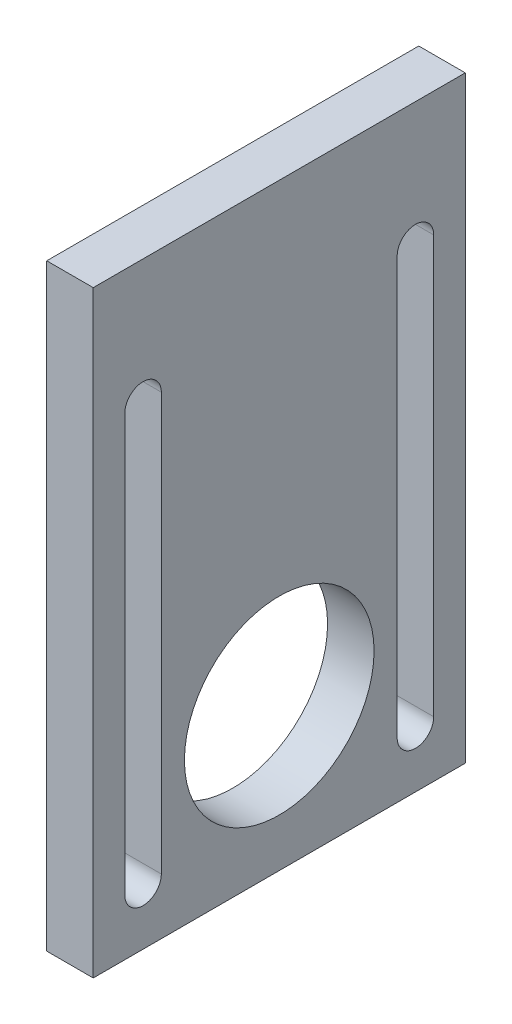
ISO-10303-21;
HEADER;
FILE_DESCRIPTION(('STEP AP214'),'2;1');
FILE_NAME('part.step','',(''),(''),'','','');
FILE_SCHEMA(('AUTOMOTIVE_DESIGN { 1 0 10303 214 1 1 1 1 }'));
ENDSEC;
DATA;
#1=APPLICATION_CONTEXT('core data for automotive mechanical design processes');
#2=APPLICATION_PROTOCOL_DEFINITION('international standard','automotive_design',2000,#1);
#3=PRODUCT_CONTEXT('',#1,'mechanical');
#4=PRODUCT('Part','Part','',(#3));
#5=PRODUCT_RELATED_PRODUCT_CATEGORY('part','',(#4));
#6=PRODUCT_DEFINITION_FORMATION('','',#4);
#7=PRODUCT_DEFINITION_CONTEXT('part definition',#1,'design');
#8=PRODUCT_DEFINITION('design','',#6,#7);
#9=PRODUCT_DEFINITION_SHAPE('','',#8);
#10=(LENGTH_UNIT() NAMED_UNIT(*) SI_UNIT(.MILLI.,.METRE.));
#11=(NAMED_UNIT(*) PLANE_ANGLE_UNIT() SI_UNIT($,.RADIAN.));
#12=(NAMED_UNIT(*) SI_UNIT($,.STERADIAN.) SOLID_ANGLE_UNIT());
#13=UNCERTAINTY_MEASURE_WITH_UNIT(LENGTH_MEASURE(1.E-05),#10,'distance_accuracy_value','');
#14=(GEOMETRIC_REPRESENTATION_CONTEXT(3) GLOBAL_UNCERTAINTY_ASSIGNED_CONTEXT((#13)) GLOBAL_UNIT_ASSIGNED_CONTEXT((#10,
#11,#12)) REPRESENTATION_CONTEXT('',''));
#15=CARTESIAN_POINT('',(0.,0.,0.));
#16=DIRECTION('',(0.,0.,1.));
#17=DIRECTION('',(1.,0.,0.));
#18=AXIS2_PLACEMENT_3D('',#15,#16,#17);
#19=CARTESIAN_POINT('',(7.,0.,0.));
#20=DIRECTION('',(0.,0.,-1.));
#21=DIRECTION('',(-1.,0.,0.));
#22=AXIS2_PLACEMENT_3D('',#19,#20,#21);
#23=PLANE('',#22);
#24=DIRECTION('',(0.,-1.,0.));
#25=VECTOR('',#24,1.);
#26=CARTESIAN_POINT('',(0.,0.,0.));
#27=LINE('',#26,#25);
#28=CARTESIAN_POINT('',(0.,90.,0.));
#29=VERTEX_POINT('',#28);
#30=CARTESIAN_POINT('',(0.,0.,0.));
#31=VERTEX_POINT('',#30);
#32=EDGE_CURVE('E199',#29,#31,#27,.T.);
#33=ORIENTED_EDGE('',*,*,#32,.T.);
#34=DIRECTION('',(-1.,0.,0.));
#35=VECTOR('',#34,1.);
#36=CARTESIAN_POINT('',(7.,0.,0.));
#37=LINE('',#36,#35);
#38=CARTESIAN_POINT('',(7.,0.,0.));
#39=VERTEX_POINT('',#38);
#40=EDGE_CURVE('E11',#39,#31,#37,.T.);
#41=ORIENTED_EDGE('',*,*,#40,.F.);
#42=DIRECTION('',(0.,-1.,0.));
#43=VECTOR('',#42,1.);
#44=CARTESIAN_POINT('',(7.,0.,0.));
#45=LINE('',#44,#43);
#46=CARTESIAN_POINT('',(7.,90.,0.));
#47=VERTEX_POINT('',#46);
#48=EDGE_CURVE('E201',#47,#39,#45,.T.);
#49=ORIENTED_EDGE('',*,*,#48,.F.);
#50=DIRECTION('',(-1.,0.,0.));
#51=VECTOR('',#50,1.);
#52=CARTESIAN_POINT('',(7.,90.,0.));
#53=LINE('',#52,#51);
#54=EDGE_CURVE('E213',#47,#29,#53,.T.);
#55=ORIENTED_EDGE('',*,*,#54,.T.);
#56=EDGE_LOOP('',(#33,#41,#49,#55));
#57=FACE_BOUND('',#56,.T.);
#58=ADVANCED_FACE('F39',(#57),#23,.F.);
#59=CARTESIAN_POINT('',(7.,0.,0.));
#60=DIRECTION('',(0.,1.,0.));
#61=DIRECTION('',(0.,0.,1.));
#62=AXIS2_PLACEMENT_3D('',#59,#60,#61);
#63=PLANE('',#62);
#64=DIRECTION('',(0.,0.,-1.));
#65=VECTOR('',#64,1.);
#66=CARTESIAN_POINT('',(0.,0.,0.));
#67=LINE('',#66,#65);
#68=CARTESIAN_POINT('',(0.,0.,-56.));
#69=VERTEX_POINT('',#68);
#70=EDGE_CURVE('E216',#31,#69,#67,.T.);
#71=ORIENTED_EDGE('',*,*,#70,.T.);
#72=DIRECTION('',(-1.,0.,0.));
#73=VECTOR('',#72,1.);
#74=CARTESIAN_POINT('',(7.,0.,-56.));
#75=LINE('',#74,#73);
#76=CARTESIAN_POINT('',(7.,0.,-56.));
#77=VERTEX_POINT('',#76);
#78=EDGE_CURVE('E46',#77,#69,#75,.T.);
#79=ORIENTED_EDGE('',*,*,#78,.F.);
#80=DIRECTION('',(0.,0.,-1.));
#81=VECTOR('',#80,1.);
#82=CARTESIAN_POINT('',(7.,0.,0.));
#83=LINE('',#82,#81);
#84=EDGE_CURVE('E206',#39,#77,#83,.T.);
#85=ORIENTED_EDGE('',*,*,#84,.F.);
#86=ORIENTED_EDGE('',*,*,#40,.T.);
#87=EDGE_LOOP('',(#71,#79,#85,#86));
#88=FACE_BOUND('',#87,.T.);
#89=ADVANCED_FACE('F243',(#88),#63,.F.);
#90=CARTESIAN_POINT('',(7.,0.,-56.));
#91=DIRECTION('',(0.,0.,1.));
#92=DIRECTION('',(1.,0.,0.));
#93=AXIS2_PLACEMENT_3D('',#90,#91,#92);
#94=PLANE('',#93);
#95=DIRECTION('',(0.,1.,0.));
#96=VECTOR('',#95,1.);
#97=CARTESIAN_POINT('',(0.,0.,-56.));
#98=LINE('',#97,#96);
#99=CARTESIAN_POINT('',(0.,90.,-56.));
#100=VERTEX_POINT('',#99);
#101=EDGE_CURVE('E217',#69,#100,#98,.T.);
#102=ORIENTED_EDGE('',*,*,#101,.T.);
#103=DIRECTION('',(-1.,0.,0.));
#104=VECTOR('',#103,1.);
#105=CARTESIAN_POINT('',(7.,90.,-56.));
#106=LINE('',#105,#104);
#107=CARTESIAN_POINT('',(7.,90.,-56.));
#108=VERTEX_POINT('',#107);
#109=EDGE_CURVE('E224',#108,#100,#106,.T.);
#110=ORIENTED_EDGE('',*,*,#109,.F.);
#111=DIRECTION('',(0.,1.,0.));
#112=VECTOR('',#111,1.);
#113=CARTESIAN_POINT('',(7.,0.,-56.));
#114=LINE('',#113,#112);
#115=EDGE_CURVE('E207',#77,#108,#114,.T.);
#116=ORIENTED_EDGE('',*,*,#115,.F.);
#117=ORIENTED_EDGE('',*,*,#78,.T.);
#118=EDGE_LOOP('',(#102,#110,#116,#117));
#119=FACE_BOUND('',#118,.T.);
#120=ADVANCED_FACE('F228',(#119),#94,.F.);
#121=CARTESIAN_POINT('',(7.,90.,0.));
#122=DIRECTION('',(0.,-1.,0.));
#123=DIRECTION('',(0.,0.,-1.));
#124=AXIS2_PLACEMENT_3D('',#121,#122,#123);
#125=PLANE('',#124);
#126=DIRECTION('',(0.,0.,1.));
#127=VECTOR('',#126,1.);
#128=CARTESIAN_POINT('',(0.,90.,0.));
#129=LINE('',#128,#127);
#130=EDGE_CURVE('E210',#100,#29,#129,.T.);
#131=ORIENTED_EDGE('',*,*,#130,.T.);
#132=ORIENTED_EDGE('',*,*,#54,.F.);
#133=DIRECTION('',(0.,0.,1.));
#134=VECTOR('',#133,1.);
#135=CARTESIAN_POINT('',(7.,90.,0.));
#136=LINE('',#135,#134);
#137=EDGE_CURVE('E211',#108,#47,#136,.T.);
#138=ORIENTED_EDGE('',*,*,#137,.F.);
#139=ORIENTED_EDGE('',*,*,#109,.T.);
#140=EDGE_LOOP('',(#131,#132,#138,#139));
#141=FACE_BOUND('',#140,.T.);
#142=ADVANCED_FACE('F236',(#141),#125,.F.);
#143=CARTESIAN_POINT('',(7.,0.,0.));
#144=DIRECTION('',(-1.,0.,0.));
#145=DIRECTION('',(0.,0.,1.));
#146=AXIS2_PLACEMENT_3D('',#143,#144,#145);
#147=PLANE('',#146);
#148=DIRECTION('',(0.,-1.,0.));
#149=VECTOR('',#148,1.);
#150=CARTESIAN_POINT('',(7.,71.2448174184033,-4.75));
#151=LINE('',#150,#149);
#152=CARTESIAN_POINT('',(7.,71.2448174184033,-4.75));
#153=VERTEX_POINT('',#152);
#154=CARTESIAN_POINT('',(7.,8.43498525922826,-4.75000000000001));
#155=VERTEX_POINT('',#154);
#156=EDGE_CURVE('E160',#153,#155,#151,.T.);
#157=ORIENTED_EDGE('',*,*,#156,.F.);
#158=CARTESIAN_POINT('',(7.,71.2448174184033,-7.5));
#159=DIRECTION('',(1.,0.,0.));
#160=DIRECTION('',(0.,0.,-1.));
#161=AXIS2_PLACEMENT_3D('',#158,#159,#160);
#162=CIRCLE('',#161,2.75);
#163=CARTESIAN_POINT('',(7.,71.2448174184033,-10.25));
#164=VERTEX_POINT('',#163);
#165=EDGE_CURVE('E52',#164,#153,#162,.T.);
#166=ORIENTED_EDGE('',*,*,#165,.F.);
#167=DIRECTION('',(0.,1.,0.));
#168=VECTOR('',#167,1.);
#169=CARTESIAN_POINT('',(7.,71.2448174184033,-10.25));
#170=LINE('',#169,#168);
#171=CARTESIAN_POINT('',(7.,8.43498525922826,-10.25));
#172=VERTEX_POINT('',#171);
#173=EDGE_CURVE('E146',#172,#164,#170,.T.);
#174=ORIENTED_EDGE('',*,*,#173,.F.);
#175=CARTESIAN_POINT('',(7.,8.43498525922826,-7.50000000000001));
#176=DIRECTION('',(1.,0.,0.));
#177=DIRECTION('',(0.,0.,-1.));
#178=AXIS2_PLACEMENT_3D('',#175,#176,#177);
#179=CIRCLE('',#178,2.75);
#180=EDGE_CURVE('E151',#155,#172,#179,.T.);
#181=ORIENTED_EDGE('',*,*,#180,.F.);
#182=EDGE_LOOP('',(#157,#166,#174,#181));
#183=FACE_BOUND('',#182,.T.);
#184=DIRECTION('',(0.,1.,0.));
#185=VECTOR('',#184,1.);
#186=CARTESIAN_POINT('',(7.,8.43498525922826,-51.25));
#187=LINE('',#186,#185);
#188=CARTESIAN_POINT('',(7.,8.43498525922826,-51.25));
#189=VERTEX_POINT('',#188);
#190=CARTESIAN_POINT('',(7.,71.2448174184033,-51.25));
#191=VERTEX_POINT('',#190);
#192=EDGE_CURVE('E181',#189,#191,#187,.T.);
#193=ORIENTED_EDGE('',*,*,#192,.F.);
#194=CARTESIAN_POINT('',(7.,8.43498525922826,-48.5));
#195=DIRECTION('',(1.,0.,0.));
#196=DIRECTION('',(0.,0.,-1.));
#197=AXIS2_PLACEMENT_3D('',#194,#195,#196);
#198=CIRCLE('',#197,2.75);
#199=CARTESIAN_POINT('',(7.,8.43498525922826,-45.75));
#200=VERTEX_POINT('',#199);
#201=EDGE_CURVE('E62',#200,#189,#198,.T.);
#202=ORIENTED_EDGE('',*,*,#201,.F.);
#203=DIRECTION('',(0.,-1.,0.));
#204=VECTOR('',#203,1.);
#205=CARTESIAN_POINT('',(7.,8.43498525922826,-45.75));
#206=LINE('',#205,#204);
#207=CARTESIAN_POINT('',(7.,71.2448174184033,-45.75));
#208=VERTEX_POINT('',#207);
#209=EDGE_CURVE('E177',#208,#200,#206,.T.);
#210=ORIENTED_EDGE('',*,*,#209,.F.);
#211=CARTESIAN_POINT('',(7.,71.2448174184033,-48.5));
#212=DIRECTION('',(1.,0.,0.));
#213=DIRECTION('',(0.,0.,-1.));
#214=AXIS2_PLACEMENT_3D('',#211,#212,#213);
#215=CIRCLE('',#214,2.75);
#216=EDGE_CURVE('E176',#191,#208,#215,.T.);
#217=ORIENTED_EDGE('',*,*,#216,.F.);
#218=EDGE_LOOP('',(#193,#202,#210,#217));
#219=FACE_BOUND('',#218,.T.);
#220=CARTESIAN_POINT('',(7.,21.5162892782246,-28.));
#221=DIRECTION('',(1.,0.,0.));
#222=DIRECTION('',(0.,0.,-1.));
#223=AXIS2_PLACEMENT_3D('',#220,#221,#222);
#224=CIRCLE('',#223,14.275);
#225=CARTESIAN_POINT('',(7.,21.5162892782246,-42.275));
#226=VERTEX_POINT('',#225);
#227=EDGE_CURVE('E162',#226,#226,#224,.T.);
#228=ORIENTED_EDGE('',*,*,#227,.F.);
#229=EDGE_LOOP('',(#228));
#230=FACE_BOUND('',#229,.T.);
#231=ORIENTED_EDGE('',*,*,#48,.T.);
#232=ORIENTED_EDGE('',*,*,#84,.T.);
#233=ORIENTED_EDGE('',*,*,#115,.T.);
#234=ORIENTED_EDGE('',*,*,#137,.T.);
#235=EDGE_LOOP('',(#231,#232,#233,#234));
#236=FACE_BOUND('',#235,.T.);
#237=ADVANCED_FACE('F241',(#183,#219,#230,#236),#147,.F.);
#238=CARTESIAN_POINT('',(0.,0.,0.));
#239=DIRECTION('',(-1.,0.,0.));
#240=DIRECTION('',(0.,0.,1.));
#241=AXIS2_PLACEMENT_3D('',#238,#239,#240);
#242=PLANE('',#241);
#243=CARTESIAN_POINT('',(0.,71.2448174184033,-7.5));
#244=DIRECTION('',(1.,0.,0.));
#245=DIRECTION('',(0.,0.,-1.));
#246=AXIS2_PLACEMENT_3D('',#243,#244,#245);
#247=CIRCLE('',#246,2.75);
#248=CARTESIAN_POINT('',(0.,71.2448174184033,-10.25));
#249=VERTEX_POINT('',#248);
#250=CARTESIAN_POINT('',(0.,71.2448174184033,-4.75));
#251=VERTEX_POINT('',#250);
#252=EDGE_CURVE('E129',#249,#251,#247,.T.);
#253=ORIENTED_EDGE('',*,*,#252,.T.);
#254=DIRECTION('',(0.,-1.,0.));
#255=VECTOR('',#254,1.);
#256=CARTESIAN_POINT('',(0.,71.2448174184033,-4.75));
#257=LINE('',#256,#255);
#258=CARTESIAN_POINT('',(0.,8.43498525922826,-4.75000000000001));
#259=VERTEX_POINT('',#258);
#260=EDGE_CURVE('E136',#251,#259,#257,.T.);
#261=ORIENTED_EDGE('',*,*,#260,.T.);
#262=CARTESIAN_POINT('',(0.,8.43498525922826,-7.50000000000001));
#263=DIRECTION('',(1.,0.,0.));
#264=DIRECTION('',(0.,0.,-1.));
#265=AXIS2_PLACEMENT_3D('',#262,#263,#264);
#266=CIRCLE('',#265,2.75);
#267=CARTESIAN_POINT('',(0.,8.43498525922826,-10.25));
#268=VERTEX_POINT('',#267);
#269=EDGE_CURVE('E141',#259,#268,#266,.T.);
#270=ORIENTED_EDGE('',*,*,#269,.T.);
#271=DIRECTION('',(0.,1.,0.));
#272=VECTOR('',#271,1.);
#273=CARTESIAN_POINT('',(0.,71.2448174184033,-10.25));
#274=LINE('',#273,#272);
#275=EDGE_CURVE('E133',#268,#249,#274,.T.);
#276=ORIENTED_EDGE('',*,*,#275,.T.);
#277=EDGE_LOOP('',(#253,#261,#270,#276));
#278=FACE_BOUND('',#277,.T.);
#279=CARTESIAN_POINT('',(0.,8.43498525922826,-48.5));
#280=DIRECTION('',(1.,0.,0.));
#281=DIRECTION('',(0.,0.,-1.));
#282=AXIS2_PLACEMENT_3D('',#279,#280,#281);
#283=CIRCLE('',#282,2.75);
#284=CARTESIAN_POINT('',(0.,8.43498525922826,-45.75));
#285=VERTEX_POINT('',#284);
#286=CARTESIAN_POINT('',(0.,8.43498525922826,-51.25));
#287=VERTEX_POINT('',#286);
#288=EDGE_CURVE('E178',#285,#287,#283,.T.);
#289=ORIENTED_EDGE('',*,*,#288,.T.);
#290=DIRECTION('',(0.,1.,0.));
#291=VECTOR('',#290,1.);
#292=CARTESIAN_POINT('',(0.,8.43498525922826,-51.25));
#293=LINE('',#292,#291);
#294=CARTESIAN_POINT('',(0.,71.2448174184033,-51.25));
#295=VERTEX_POINT('',#294);
#296=EDGE_CURVE('E194',#287,#295,#293,.T.);
#297=ORIENTED_EDGE('',*,*,#296,.T.);
#298=CARTESIAN_POINT('',(0.,71.2448174184033,-48.5));
#299=DIRECTION('',(1.,0.,0.));
#300=DIRECTION('',(0.,0.,-1.));
#301=AXIS2_PLACEMENT_3D('',#298,#299,#300);
#302=CIRCLE('',#301,2.75);
#303=CARTESIAN_POINT('',(0.,71.2448174184033,-45.75));
#304=VERTEX_POINT('',#303);
#305=EDGE_CURVE('E186',#295,#304,#302,.T.);
#306=ORIENTED_EDGE('',*,*,#305,.T.);
#307=DIRECTION('',(0.,-1.,0.));
#308=VECTOR('',#307,1.);
#309=CARTESIAN_POINT('',(0.,8.43498525922826,-45.75));
#310=LINE('',#309,#308);
#311=EDGE_CURVE('E166',#304,#285,#310,.T.);
#312=ORIENTED_EDGE('',*,*,#311,.T.);
#313=EDGE_LOOP('',(#289,#297,#306,#312));
#314=FACE_BOUND('',#313,.T.);
#315=CARTESIAN_POINT('',(0.,21.5162892782246,-28.));
#316=DIRECTION('',(1.,0.,0.));
#317=DIRECTION('',(0.,0.,-1.));
#318=AXIS2_PLACEMENT_3D('',#315,#316,#317);
#319=CIRCLE('',#318,14.275);
#320=CARTESIAN_POINT('',(0.,21.5162892782246,-42.275));
#321=VERTEX_POINT('',#320);
#322=EDGE_CURVE('E197',#321,#321,#319,.T.);
#323=ORIENTED_EDGE('',*,*,#322,.T.);
#324=EDGE_LOOP('',(#323));
#325=FACE_BOUND('',#324,.T.);
#326=ORIENTED_EDGE('',*,*,#32,.F.);
#327=ORIENTED_EDGE('',*,*,#130,.F.);
#328=ORIENTED_EDGE('',*,*,#101,.F.);
#329=ORIENTED_EDGE('',*,*,#70,.F.);
#330=EDGE_LOOP('',(#326,#327,#328,#329));
#331=FACE_BOUND('',#330,.T.);
#332=ADVANCED_FACE('F144',(#278,#314,#325,#331),#242,.T.);
#333=CARTESIAN_POINT('',(0.,21.5162892782246,-28.));
#334=DIRECTION('',(1.,0.,0.));
#335=DIRECTION('',(0.,0.,-1.));
#336=AXIS2_PLACEMENT_3D('',#333,#334,#335);
#337=CYLINDRICAL_SURFACE('',#336,14.275);
#338=ORIENTED_EDGE('',*,*,#322,.F.);
#339=EDGE_LOOP('',(#338));
#340=FACE_BOUND('',#339,.T.);
#341=ORIENTED_EDGE('',*,*,#227,.T.);
#342=EDGE_LOOP('',(#341));
#343=FACE_BOUND('',#342,.T.);
#344=ADVANCED_FACE('F260',(#340,#343),#337,.F.);
#345=CARTESIAN_POINT('',(0.,8.43498525922826,-48.5));
#346=DIRECTION('',(1.,0.,0.));
#347=DIRECTION('',(0.,0.,-1.));
#348=AXIS2_PLACEMENT_3D('',#345,#346,#347);
#349=CYLINDRICAL_SURFACE('',#348,2.75);
#350=ORIENTED_EDGE('',*,*,#201,.T.);
#351=DIRECTION('',(1.,0.,0.));
#352=VECTOR('',#351,1.);
#353=CARTESIAN_POINT('',(0.,8.43498525922826,-51.25));
#354=LINE('',#353,#352);
#355=EDGE_CURVE('E170',#287,#189,#354,.T.);
#356=ORIENTED_EDGE('',*,*,#355,.F.);
#357=ORIENTED_EDGE('',*,*,#288,.F.);
#358=DIRECTION('',(1.,0.,0.));
#359=VECTOR('',#358,1.);
#360=CARTESIAN_POINT('',(0.,8.43498525922826,-45.75));
#361=LINE('',#360,#359);
#362=EDGE_CURVE('E171',#285,#200,#361,.T.);
#363=ORIENTED_EDGE('',*,*,#362,.T.);
#364=EDGE_LOOP('',(#350,#356,#357,#363));
#365=FACE_BOUND('',#364,.T.);
#366=ADVANCED_FACE('F263',(#365),#349,.F.);
#367=CARTESIAN_POINT('',(0.,8.43498525922826,-45.75));
#368=DIRECTION('',(0.,0.,1.));
#369=DIRECTION('',(1.,0.,0.));
#370=AXIS2_PLACEMENT_3D('',#367,#368,#369);
#371=PLANE('',#370);
#372=ORIENTED_EDGE('',*,*,#209,.T.);
#373=ORIENTED_EDGE('',*,*,#362,.F.);
#374=ORIENTED_EDGE('',*,*,#311,.F.);
#375=DIRECTION('',(1.,0.,0.));
#376=VECTOR('',#375,1.);
#377=CARTESIAN_POINT('',(0.,71.2448174184033,-45.75));
#378=LINE('',#377,#376);
#379=EDGE_CURVE('E174',#304,#208,#378,.T.);
#380=ORIENTED_EDGE('',*,*,#379,.T.);
#381=EDGE_LOOP('',(#372,#373,#374,#380));
#382=FACE_BOUND('',#381,.T.);
#383=ADVANCED_FACE('F264',(#382),#371,.F.);
#384=CARTESIAN_POINT('',(0.,71.2448174184033,-48.5));
#385=DIRECTION('',(1.,0.,0.));
#386=DIRECTION('',(0.,0.,-1.));
#387=AXIS2_PLACEMENT_3D('',#384,#385,#386);
#388=CYLINDRICAL_SURFACE('',#387,2.75);
#389=ORIENTED_EDGE('',*,*,#216,.T.);
#390=ORIENTED_EDGE('',*,*,#379,.F.);
#391=ORIENTED_EDGE('',*,*,#305,.F.);
#392=DIRECTION('',(1.,0.,0.));
#393=VECTOR('',#392,1.);
#394=CARTESIAN_POINT('',(0.,71.2448174184033,-51.25));
#395=LINE('',#394,#393);
#396=EDGE_CURVE('E168',#295,#191,#395,.T.);
#397=ORIENTED_EDGE('',*,*,#396,.T.);
#398=EDGE_LOOP('',(#389,#390,#391,#397));
#399=FACE_BOUND('',#398,.T.);
#400=ADVANCED_FACE('F268',(#399),#388,.F.);
#401=CARTESIAN_POINT('',(0.,8.43498525922826,-51.25));
#402=DIRECTION('',(0.,0.,-1.));
#403=DIRECTION('',(-1.,0.,0.));
#404=AXIS2_PLACEMENT_3D('',#401,#402,#403);
#405=PLANE('',#404);
#406=ORIENTED_EDGE('',*,*,#192,.T.);
#407=ORIENTED_EDGE('',*,*,#396,.F.);
#408=ORIENTED_EDGE('',*,*,#296,.F.);
#409=ORIENTED_EDGE('',*,*,#355,.T.);
#410=EDGE_LOOP('',(#406,#407,#408,#409));
#411=FACE_BOUND('',#410,.T.);
#412=ADVANCED_FACE('F275',(#411),#405,.F.);
#413=CARTESIAN_POINT('',(0.,71.2448174184033,-7.5));
#414=DIRECTION('',(1.,0.,0.));
#415=DIRECTION('',(0.,0.,-1.));
#416=AXIS2_PLACEMENT_3D('',#413,#414,#415);
#417=CYLINDRICAL_SURFACE('',#416,2.75);
#418=ORIENTED_EDGE('',*,*,#165,.T.);
#419=DIRECTION('',(1.,0.,0.));
#420=VECTOR('',#419,1.);
#421=CARTESIAN_POINT('',(0.,71.2448174184033,-4.75));
#422=LINE('',#421,#420);
#423=EDGE_CURVE('E123',#251,#153,#422,.T.);
#424=ORIENTED_EDGE('',*,*,#423,.F.);
#425=ORIENTED_EDGE('',*,*,#252,.F.);
#426=DIRECTION('',(1.,0.,0.));
#427=VECTOR('',#426,1.);
#428=CARTESIAN_POINT('',(0.,71.2448174184033,-10.25));
#429=LINE('',#428,#427);
#430=EDGE_CURVE('E161',#249,#164,#429,.T.);
#431=ORIENTED_EDGE('',*,*,#430,.T.);
#432=EDGE_LOOP('',(#418,#424,#425,#431));
#433=FACE_BOUND('',#432,.T.);
#434=ADVANCED_FACE('F130',(#433),#417,.F.);
#435=CARTESIAN_POINT('',(0.,71.2448174184033,-10.25));
#436=DIRECTION('',(0.,0.,-1.));
#437=DIRECTION('',(0.,1.,0.));
#438=AXIS2_PLACEMENT_3D('',#435,#436,#437);
#439=PLANE('',#438);
#440=ORIENTED_EDGE('',*,*,#173,.T.);
#441=ORIENTED_EDGE('',*,*,#430,.F.);
#442=ORIENTED_EDGE('',*,*,#275,.F.);
#443=DIRECTION('',(1.,0.,0.));
#444=VECTOR('',#443,1.);
#445=CARTESIAN_POINT('',(0.,8.43498525922826,-10.25));
#446=LINE('',#445,#444);
#447=EDGE_CURVE('E163',#268,#172,#446,.T.);
#448=ORIENTED_EDGE('',*,*,#447,.T.);
#449=EDGE_LOOP('',(#440,#441,#442,#448));
#450=FACE_BOUND('',#449,.T.);
#451=ADVANCED_FACE('F282',(#450),#439,.F.);
#452=CARTESIAN_POINT('',(0.,8.43498525922826,-7.50000000000001));
#453=DIRECTION('',(1.,0.,0.));
#454=DIRECTION('',(0.,0.,-1.));
#455=AXIS2_PLACEMENT_3D('',#452,#453,#454);
#456=CYLINDRICAL_SURFACE('',#455,2.75);
#457=ORIENTED_EDGE('',*,*,#180,.T.);
#458=ORIENTED_EDGE('',*,*,#447,.F.);
#459=ORIENTED_EDGE('',*,*,#269,.F.);
#460=DIRECTION('',(1.,0.,0.));
#461=VECTOR('',#460,1.);
#462=CARTESIAN_POINT('',(0.,8.43498525922826,-4.75000000000001));
#463=LINE('',#462,#461);
#464=EDGE_CURVE('E131',#259,#155,#463,.T.);
#465=ORIENTED_EDGE('',*,*,#464,.T.);
#466=EDGE_LOOP('',(#457,#458,#459,#465));
#467=FACE_BOUND('',#466,.T.);
#468=ADVANCED_FACE('F281',(#467),#456,.F.);
#469=CARTESIAN_POINT('',(0.,71.2448174184033,-4.75));
#470=DIRECTION('',(0.,0.,1.));
#471=DIRECTION('',(0.,-1.,0.));
#472=AXIS2_PLACEMENT_3D('',#469,#470,#471);
#473=PLANE('',#472);
#474=ORIENTED_EDGE('',*,*,#156,.T.);
#475=ORIENTED_EDGE('',*,*,#464,.F.);
#476=ORIENTED_EDGE('',*,*,#260,.F.);
#477=ORIENTED_EDGE('',*,*,#423,.T.);
#478=EDGE_LOOP('',(#474,#475,#476,#477));
#479=FACE_BOUND('',#478,.T.);
#480=ADVANCED_FACE('F138',(#479),#473,.F.);
#481=CLOSED_SHELL('',(#58,#89,#120,#142,#237,#332,#344,#366,#383,#400,#412,#434,#451,#468,#480));
#482=MANIFOLD_SOLID_BREP('B2',#481);
#483=ADVANCED_BREP_SHAPE_REPRESENTATION('',(#18,#482),#14);
#484=SHAPE_DEFINITION_REPRESENTATION(#9,#483);
ENDSEC;
END-ISO-10303-21;
